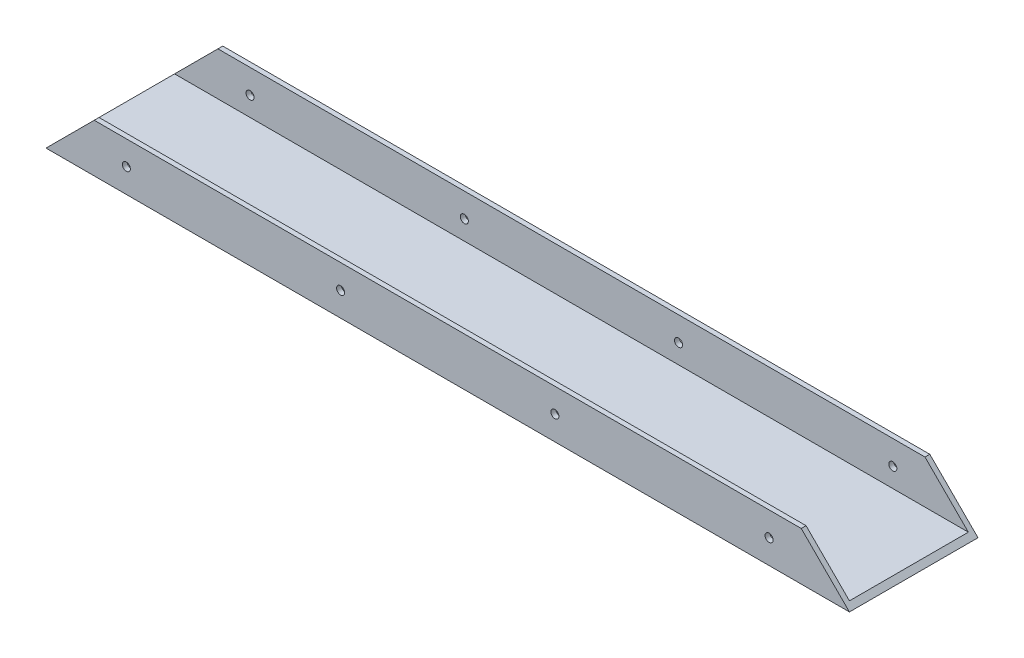
ISO-10303-21;
HEADER;
FILE_DESCRIPTION(('STEP AP214'),'2;1');
FILE_NAME('part.step','',(''),(''),'','','');
FILE_SCHEMA(('AUTOMOTIVE_DESIGN { 1 0 10303 214 1 1 1 1 }'));
ENDSEC;
DATA;
#1=APPLICATION_CONTEXT('core data for automotive mechanical design processes');
#2=APPLICATION_PROTOCOL_DEFINITION('international standard','automotive_design',2000,#1);
#3=PRODUCT_CONTEXT('',#1,'mechanical');
#4=PRODUCT('Part','Part','',(#3));
#5=PRODUCT_RELATED_PRODUCT_CATEGORY('part','',(#4));
#6=PRODUCT_DEFINITION_FORMATION('','',#4);
#7=PRODUCT_DEFINITION_CONTEXT('part definition',#1,'design');
#8=PRODUCT_DEFINITION('design','',#6,#7);
#9=PRODUCT_DEFINITION_SHAPE('','',#8);
#10=(LENGTH_UNIT() NAMED_UNIT(*) SI_UNIT(.MILLI.,.METRE.));
#11=(NAMED_UNIT(*) PLANE_ANGLE_UNIT() SI_UNIT($,.RADIAN.));
#12=(NAMED_UNIT(*) SI_UNIT($,.STERADIAN.) SOLID_ANGLE_UNIT());
#13=UNCERTAINTY_MEASURE_WITH_UNIT(LENGTH_MEASURE(1.E-05),#10,'distance_accuracy_value','');
#14=(GEOMETRIC_REPRESENTATION_CONTEXT(3) GLOBAL_UNCERTAINTY_ASSIGNED_CONTEXT((#13)) GLOBAL_UNIT_ASSIGNED_CONTEXT((#10,
#11,#12)) REPRESENTATION_CONTEXT('',''));
#15=CARTESIAN_POINT('',(0.,0.,0.));
#16=DIRECTION('',(0.,0.,1.));
#17=DIRECTION('',(1.,0.,0.));
#18=AXIS2_PLACEMENT_3D('',#15,#16,#17);
#19=CARTESIAN_POINT('',(250.,15.,-18.5));
#20=DIRECTION('',(0.,0.,-1.));
#21=DIRECTION('',(0.,1.,0.));
#22=AXIS2_PLACEMENT_3D('',#19,#20,#21);
#23=PLANE('',#22);
#24=CARTESIAN_POINT('',(91.6666666666667,7.50000000000018,-18.5));
#25=DIRECTION('',(0.,0.,-1.));
#26=DIRECTION('',(0.,1.,0.));
#27=AXIS2_PLACEMENT_3D('',#24,#25,#26);
#28=CIRCLE('',#27,1.25000000000001);
#29=CARTESIAN_POINT('',(91.6666666666667,8.75000000000019,-18.5));
#30=VERTEX_POINT('',#29);
#31=EDGE_CURVE('E166',#30,#30,#28,.T.);
#32=ORIENTED_EDGE('',*,*,#31,.T.);
#33=EDGE_LOOP('',(#32));
#34=FACE_BOUND('',#33,.T.);
#35=CARTESIAN_POINT('',(158.333333333333,7.49999999999995,-18.5));
#36=DIRECTION('',(0.,0.,-1.));
#37=DIRECTION('',(0.,1.,0.));
#38=AXIS2_PLACEMENT_3D('',#35,#36,#37);
#39=CIRCLE('',#38,1.25000000000001);
#40=CARTESIAN_POINT('',(158.333333333333,8.74999999999997,-18.5));
#41=VERTEX_POINT('',#40);
#42=EDGE_CURVE('E160',#41,#41,#39,.T.);
#43=ORIENTED_EDGE('',*,*,#42,.T.);
#44=EDGE_LOOP('',(#43));
#45=FACE_BOUND('',#44,.T.);
#46=CARTESIAN_POINT('',(225.,7.49999999999973,-18.5));
#47=DIRECTION('',(0.,0.,-1.));
#48=DIRECTION('',(0.,1.,0.));
#49=AXIS2_PLACEMENT_3D('',#46,#47,#48);
#50=CIRCLE('',#49,1.24999999999996);
#51=CARTESIAN_POINT('',(225.,8.74999999999969,-18.5));
#52=VERTEX_POINT('',#51);
#53=EDGE_CURVE('E154',#52,#52,#50,.T.);
#54=ORIENTED_EDGE('',*,*,#53,.T.);
#55=EDGE_LOOP('',(#54));
#56=FACE_BOUND('',#55,.T.);
#57=CARTESIAN_POINT('',(25.,7.50000000000043,-18.5));
#58=DIRECTION('',(0.,0.,-1.));
#59=DIRECTION('',(0.,1.,0.));
#60=AXIS2_PLACEMENT_3D('',#57,#58,#59);
#61=CIRCLE('',#60,1.24999999999996);
#62=CARTESIAN_POINT('',(25.,8.75000000000039,-18.5));
#63=VERTEX_POINT('',#62);
#64=EDGE_CURVE('E148',#63,#63,#61,.T.);
#65=ORIENTED_EDGE('',*,*,#64,.T.);
#66=EDGE_LOOP('',(#65));
#67=FACE_BOUND('',#66,.T.);
#68=DIRECTION('',(-1.,0.,0.));
#69=VECTOR('',#68,1.);
#70=CARTESIAN_POINT('',(250.,1.5,-18.5));
#71=LINE('',#70,#69);
#72=CARTESIAN_POINT('',(248.5,1.5,-18.5));
#73=VERTEX_POINT('',#72);
#74=CARTESIAN_POINT('',(1.5,1.5,-18.5));
#75=VERTEX_POINT('',#74);
#76=EDGE_CURVE('E11',#73,#75,#71,.T.);
#77=ORIENTED_EDGE('',*,*,#76,.F.);
#78=DIRECTION('',(-0.707106781186548,0.707106781186547,0.));
#79=VECTOR('',#78,1.);
#80=CARTESIAN_POINT('',(242.5,7.5,-18.5));
#81=LINE('',#80,#79);
#82=CARTESIAN_POINT('',(235.,15.,-18.5));
#83=VERTEX_POINT('',#82);
#84=EDGE_CURVE('E142',#73,#83,#81,.T.);
#85=ORIENTED_EDGE('',*,*,#84,.T.);
#86=DIRECTION('',(-1.,0.,0.));
#87=VECTOR('',#86,1.);
#88=CARTESIAN_POINT('',(250.,15.,-18.5));
#89=LINE('',#88,#87);
#90=CARTESIAN_POINT('',(15.,15.,-18.5));
#91=VERTEX_POINT('',#90);
#92=EDGE_CURVE('E172',#83,#91,#89,.T.);
#93=ORIENTED_EDGE('',*,*,#92,.T.);
#94=DIRECTION('',(-0.707106781186548,-0.707106781186547,0.));
#95=VECTOR('',#94,1.);
#96=CARTESIAN_POINT('',(132.5,132.5,-18.5));
#97=LINE('',#96,#95);
#98=EDGE_CURVE('E134',#91,#75,#97,.T.);
#99=ORIENTED_EDGE('',*,*,#98,.T.);
#100=EDGE_LOOP('',(#77,#85,#93,#99));
#101=FACE_BOUND('',#100,.T.);
#102=ADVANCED_FACE('F32',(#34,#45,#56,#67,#101),#23,.F.);
#103=CARTESIAN_POINT('',(250.,1.5,-18.5));
#104=DIRECTION('',(0.,-1.,0.));
#105=DIRECTION('',(0.,0.,-1.));
#106=AXIS2_PLACEMENT_3D('',#103,#104,#105);
#107=PLANE('',#106);
#108=DIRECTION('',(-1.,0.,0.));
#109=VECTOR('',#108,1.);
#110=CARTESIAN_POINT('',(250.,1.5,18.5));
#111=LINE('',#110,#109);
#112=CARTESIAN_POINT('',(248.5,1.5,18.5));
#113=VERTEX_POINT('',#112);
#114=CARTESIAN_POINT('',(1.49999999999999,1.49999999999999,18.5));
#115=VERTEX_POINT('',#114);
#116=EDGE_CURVE('E40',#113,#115,#111,.T.);
#117=ORIENTED_EDGE('',*,*,#116,.F.);
#118=DIRECTION('',(0.,0.,-1.));
#119=VECTOR('',#118,1.);
#120=CARTESIAN_POINT('',(248.5,1.5,-18.5));
#121=LINE('',#120,#119);
#122=EDGE_CURVE('E129',#113,#73,#121,.T.);
#123=ORIENTED_EDGE('',*,*,#122,.T.);
#124=ORIENTED_EDGE('',*,*,#76,.T.);
#125=DIRECTION('',(0.,0.,1.));
#126=VECTOR('',#125,1.);
#127=CARTESIAN_POINT('',(1.5,1.5,-18.5));
#128=LINE('',#127,#126);
#129=EDGE_CURVE('E131',#75,#115,#128,.T.);
#130=ORIENTED_EDGE('',*,*,#129,.T.);
#131=EDGE_LOOP('',(#117,#123,#124,#130));
#132=FACE_BOUND('',#131,.T.);
#133=ADVANCED_FACE('F128',(#132),#107,.F.);
#134=CARTESIAN_POINT('',(250.,1.5,18.5));
#135=DIRECTION('',(0.,0.,1.));
#136=DIRECTION('',(1.,0.,0.));
#137=AXIS2_PLACEMENT_3D('',#134,#135,#136);
#138=PLANE('',#137);
#139=CARTESIAN_POINT('',(91.6666666666667,7.50000000000017,18.5));
#140=DIRECTION('',(0.,0.,1.));
#141=DIRECTION('',(1.,0.,0.));
#142=AXIS2_PLACEMENT_3D('',#139,#140,#141);
#143=CIRCLE('',#142,1.25000000000001);
#144=CARTESIAN_POINT('',(92.9166666666667,7.50000000000017,18.5));
#145=VERTEX_POINT('',#144);
#146=EDGE_CURVE('E163',#145,#145,#143,.T.);
#147=ORIENTED_EDGE('',*,*,#146,.T.);
#148=EDGE_LOOP('',(#147));
#149=FACE_BOUND('',#148,.T.);
#150=CARTESIAN_POINT('',(158.333333333333,7.49999999999995,18.5));
#151=DIRECTION('',(0.,0.,1.));
#152=DIRECTION('',(1.,0.,0.));
#153=AXIS2_PLACEMENT_3D('',#150,#151,#152);
#154=CIRCLE('',#153,1.25000000000001);
#155=CARTESIAN_POINT('',(159.583333333333,7.49999999999995,18.5));
#156=VERTEX_POINT('',#155);
#157=EDGE_CURVE('E157',#156,#156,#154,.T.);
#158=ORIENTED_EDGE('',*,*,#157,.T.);
#159=EDGE_LOOP('',(#158));
#160=FACE_BOUND('',#159,.T.);
#161=CARTESIAN_POINT('',(225.,7.49999999999972,18.5));
#162=DIRECTION('',(0.,0.,1.));
#163=DIRECTION('',(1.,0.,0.));
#164=AXIS2_PLACEMENT_3D('',#161,#162,#163);
#165=CIRCLE('',#164,1.24999999999996);
#166=CARTESIAN_POINT('',(226.25,7.49999999999972,18.5));
#167=VERTEX_POINT('',#166);
#168=EDGE_CURVE('E151',#167,#167,#165,.T.);
#169=ORIENTED_EDGE('',*,*,#168,.T.);
#170=EDGE_LOOP('',(#169));
#171=FACE_BOUND('',#170,.T.);
#172=CARTESIAN_POINT('',(25.,7.50000000000042,18.5));
#173=DIRECTION('',(0.,0.,1.));
#174=DIRECTION('',(1.,0.,0.));
#175=AXIS2_PLACEMENT_3D('',#172,#173,#174);
#176=CIRCLE('',#175,1.24999999999996);
#177=CARTESIAN_POINT('',(26.25,7.50000000000042,18.5));
#178=VERTEX_POINT('',#177);
#179=EDGE_CURVE('E145',#178,#178,#176,.T.);
#180=ORIENTED_EDGE('',*,*,#179,.T.);
#181=EDGE_LOOP('',(#180));
#182=FACE_BOUND('',#181,.T.);
#183=DIRECTION('',(-1.,0.,0.));
#184=VECTOR('',#183,1.);
#185=CARTESIAN_POINT('',(250.,15.,18.5));
#186=LINE('',#185,#184);
#187=CARTESIAN_POINT('',(235.,15.,18.5));
#188=VERTEX_POINT('',#187);
#189=CARTESIAN_POINT('',(15.,15.,18.5));
#190=VERTEX_POINT('',#189);
#191=EDGE_CURVE('E114',#188,#190,#186,.T.);
#192=ORIENTED_EDGE('',*,*,#191,.F.);
#193=DIRECTION('',(0.707106781186548,-0.707106781186547,0.));
#194=VECTOR('',#193,1.);
#195=CARTESIAN_POINT('',(249.25,0.75,18.5));
#196=LINE('',#195,#194);
#197=EDGE_CURVE('E93',#188,#113,#196,.T.);
#198=ORIENTED_EDGE('',*,*,#197,.T.);
#199=ORIENTED_EDGE('',*,*,#116,.T.);
#200=DIRECTION('',(0.707106781186548,0.707106781186547,0.));
#201=VECTOR('',#200,1.);
#202=CARTESIAN_POINT('',(125.75,125.75,18.5));
#203=LINE('',#202,#201);
#204=EDGE_CURVE('E98',#115,#190,#203,.T.);
#205=ORIENTED_EDGE('',*,*,#204,.T.);
#206=EDGE_LOOP('',(#192,#198,#199,#205));
#207=FACE_BOUND('',#206,.T.);
#208=ADVANCED_FACE('F124',(#149,#160,#171,#182,#207),#138,.F.);
#209=CARTESIAN_POINT('',(250.,15.,18.5));
#210=DIRECTION('',(0.,-1.,0.));
#211=DIRECTION('',(0.,0.,-1.));
#212=AXIS2_PLACEMENT_3D('',#209,#210,#211);
#213=PLANE('',#212);
#214=DIRECTION('',(-1.,0.,0.));
#215=VECTOR('',#214,1.);
#216=CARTESIAN_POINT('',(250.,15.,20.));
#217=LINE('',#216,#215);
#218=CARTESIAN_POINT('',(235.,15.,20.));
#219=VERTEX_POINT('',#218);
#220=CARTESIAN_POINT('',(15.,15.,20.));
#221=VERTEX_POINT('',#220);
#222=EDGE_CURVE('E105',#219,#221,#217,.T.);
#223=ORIENTED_EDGE('',*,*,#222,.F.);
#224=DIRECTION('',(0.,0.,-1.));
#225=VECTOR('',#224,1.);
#226=CARTESIAN_POINT('',(235.,15.,20.));
#227=LINE('',#226,#225);
#228=EDGE_CURVE('E90',#219,#188,#227,.T.);
#229=ORIENTED_EDGE('',*,*,#228,.T.);
#230=ORIENTED_EDGE('',*,*,#191,.T.);
#231=DIRECTION('',(0.,0.,-1.));
#232=VECTOR('',#231,1.);
#233=CARTESIAN_POINT('',(15.,15.,20.));
#234=LINE('',#233,#232);
#235=EDGE_CURVE('E113',#221,#190,#234,.T.);
#236=ORIENTED_EDGE('',*,*,#235,.F.);
#237=EDGE_LOOP('',(#223,#229,#230,#236));
#238=FACE_BOUND('',#237,.T.);
#239=ADVANCED_FACE('F112',(#238),#213,.F.);
#240=CARTESIAN_POINT('',(250.,15.,20.));
#241=DIRECTION('',(0.,0.,-1.));
#242=DIRECTION('',(0.,1.,0.));
#243=AXIS2_PLACEMENT_3D('',#240,#241,#242);
#244=PLANE('',#243);
#245=CARTESIAN_POINT('',(91.6666666666667,7.50000000000017,20.));
#246=DIRECTION('',(0.,0.,-1.));
#247=DIRECTION('',(0.,1.,0.));
#248=AXIS2_PLACEMENT_3D('',#245,#246,#247);
#249=CIRCLE('',#248,1.25000000000001);
#250=CARTESIAN_POINT('',(91.6666666666667,8.75000000000018,20.));
#251=VERTEX_POINT('',#250);
#252=EDGE_CURVE('E215',#251,#251,#249,.T.);
#253=ORIENTED_EDGE('',*,*,#252,.T.);
#254=EDGE_LOOP('',(#253));
#255=FACE_BOUND('',#254,.T.);
#256=CARTESIAN_POINT('',(158.333333333333,7.49999999999995,20.));
#257=DIRECTION('',(0.,0.,-1.));
#258=DIRECTION('',(0.,1.,0.));
#259=AXIS2_PLACEMENT_3D('',#256,#257,#258);
#260=CIRCLE('',#259,1.25000000000001);
#261=CARTESIAN_POINT('',(158.333333333333,8.74999999999996,20.));
#262=VERTEX_POINT('',#261);
#263=EDGE_CURVE('E211',#262,#262,#260,.T.);
#264=ORIENTED_EDGE('',*,*,#263,.T.);
#265=EDGE_LOOP('',(#264));
#266=FACE_BOUND('',#265,.T.);
#267=CARTESIAN_POINT('',(225.,7.49999999999972,20.));
#268=DIRECTION('',(0.,0.,-1.));
#269=DIRECTION('',(0.,1.,0.));
#270=AXIS2_PLACEMENT_3D('',#267,#268,#269);
#271=CIRCLE('',#270,1.24999999999996);
#272=CARTESIAN_POINT('',(225.,8.74999999999968,20.));
#273=VERTEX_POINT('',#272);
#274=EDGE_CURVE('E205',#273,#273,#271,.T.);
#275=ORIENTED_EDGE('',*,*,#274,.T.);
#276=EDGE_LOOP('',(#275));
#277=FACE_BOUND('',#276,.T.);
#278=CARTESIAN_POINT('',(25.,7.50000000000042,20.));
#279=DIRECTION('',(0.,0.,-1.));
#280=DIRECTION('',(0.,-1.,0.));
#281=AXIS2_PLACEMENT_3D('',#278,#279,#280);
#282=CIRCLE('',#281,1.24999999999996);
#283=CARTESIAN_POINT('',(25.,6.25000000000046,20.));
#284=VERTEX_POINT('',#283);
#285=EDGE_CURVE('E194',#284,#284,#282,.T.);
#286=ORIENTED_EDGE('',*,*,#285,.T.);
#287=EDGE_LOOP('',(#286));
#288=FACE_BOUND('',#287,.T.);
#289=DIRECTION('',(-1.,0.,0.));
#290=VECTOR('',#289,1.);
#291=CARTESIAN_POINT('',(250.,0.,20.));
#292=LINE('',#291,#290);
#293=CARTESIAN_POINT('',(250.,0.,20.));
#294=VERTEX_POINT('',#293);
#295=CARTESIAN_POINT('',(0.,0.,20.));
#296=VERTEX_POINT('',#295);
#297=EDGE_CURVE('E107',#294,#296,#292,.T.);
#298=ORIENTED_EDGE('',*,*,#297,.F.);
#299=DIRECTION('',(-0.707106781186548,0.707106781186547,0.));
#300=VECTOR('',#299,1.);
#301=CARTESIAN_POINT('',(235.,15.,20.));
#302=LINE('',#301,#300);
#303=EDGE_CURVE('E46',#294,#219,#302,.T.);
#304=ORIENTED_EDGE('',*,*,#303,.T.);
#305=ORIENTED_EDGE('',*,*,#222,.T.);
#306=DIRECTION('',(-0.707106781186548,-0.707106781186547,0.));
#307=VECTOR('',#306,1.);
#308=CARTESIAN_POINT('',(15.,15.,20.));
#309=LINE('',#308,#307);
#310=EDGE_CURVE('E190',#221,#296,#309,.T.);
#311=ORIENTED_EDGE('',*,*,#310,.T.);
#312=EDGE_LOOP('',(#298,#304,#305,#311));
#313=FACE_BOUND('',#312,.T.);
#314=ADVANCED_FACE('F103',(#255,#266,#277,#288,#313),#244,.F.);
#315=CARTESIAN_POINT('',(250.,0.,20.));
#316=DIRECTION('',(0.,1.,0.));
#317=DIRECTION('',(0.,0.,1.));
#318=AXIS2_PLACEMENT_3D('',#315,#316,#317);
#319=PLANE('',#318);
#320=DIRECTION('',(0.,0.,-1.));
#321=VECTOR('',#320,1.);
#322=CARTESIAN_POINT('',(0.,0.,20.));
#323=LINE('',#322,#321);
#324=CARTESIAN_POINT('',(0.,0.,-20.));
#325=VERTEX_POINT('',#324);
#326=EDGE_CURVE('E169',#296,#325,#323,.T.);
#327=ORIENTED_EDGE('',*,*,#326,.T.);
#328=DIRECTION('',(-1.,0.,0.));
#329=VECTOR('',#328,1.);
#330=CARTESIAN_POINT('',(250.,0.,-20.));
#331=LINE('',#330,#329);
#332=CARTESIAN_POINT('',(250.,0.,-20.));
#333=VERTEX_POINT('',#332);
#334=EDGE_CURVE('E117',#333,#325,#331,.T.);
#335=ORIENTED_EDGE('',*,*,#334,.F.);
#336=DIRECTION('',(0.,0.,-1.));
#337=VECTOR('',#336,1.);
#338=CARTESIAN_POINT('',(250.,0.,20.));
#339=LINE('',#338,#337);
#340=EDGE_CURVE('E170',#294,#333,#339,.T.);
#341=ORIENTED_EDGE('',*,*,#340,.F.);
#342=ORIENTED_EDGE('',*,*,#297,.T.);
#343=EDGE_LOOP('',(#327,#335,#341,#342));
#344=FACE_BOUND('',#343,.T.);
#345=ADVANCED_FACE('F188',(#344),#319,.F.);
#346=CARTESIAN_POINT('',(250.,0.,-20.));
#347=DIRECTION('',(0.,0.,1.));
#348=DIRECTION('',(0.,-1.,0.));
#349=AXIS2_PLACEMENT_3D('',#346,#347,#348);
#350=PLANE('',#349);
#351=CARTESIAN_POINT('',(91.6666666666667,7.50000000000018,-20.));
#352=DIRECTION('',(0.,0.,-1.));
#353=DIRECTION('',(0.,1.,0.));
#354=AXIS2_PLACEMENT_3D('',#351,#352,#353);
#355=CIRCLE('',#354,1.25000000000001);
#356=CARTESIAN_POINT('',(91.6666666666667,8.75000000000019,-20.));
#357=VERTEX_POINT('',#356);
#358=EDGE_CURVE('E197',#357,#357,#355,.T.);
#359=ORIENTED_EDGE('',*,*,#358,.F.);
#360=EDGE_LOOP('',(#359));
#361=FACE_BOUND('',#360,.T.);
#362=CARTESIAN_POINT('',(158.333333333333,7.49999999999996,-20.));
#363=DIRECTION('',(0.,0.,-1.));
#364=DIRECTION('',(0.,1.,0.));
#365=AXIS2_PLACEMENT_3D('',#362,#363,#364);
#366=CIRCLE('',#365,1.25000000000001);
#367=CARTESIAN_POINT('',(158.333333333333,8.74999999999997,-20.));
#368=VERTEX_POINT('',#367);
#369=EDGE_CURVE('E213',#368,#368,#366,.T.);
#370=ORIENTED_EDGE('',*,*,#369,.F.);
#371=EDGE_LOOP('',(#370));
#372=FACE_BOUND('',#371,.T.);
#373=CARTESIAN_POINT('',(225.,7.49999999999973,-20.));
#374=DIRECTION('',(0.,0.,-1.));
#375=DIRECTION('',(0.,1.,0.));
#376=AXIS2_PLACEMENT_3D('',#373,#374,#375);
#377=CIRCLE('',#376,1.24999999999996);
#378=CARTESIAN_POINT('',(225.,8.74999999999969,-20.));
#379=VERTEX_POINT('',#378);
#380=EDGE_CURVE('E208',#379,#379,#377,.T.);
#381=ORIENTED_EDGE('',*,*,#380,.F.);
#382=EDGE_LOOP('',(#381));
#383=FACE_BOUND('',#382,.T.);
#384=CARTESIAN_POINT('',(25.,7.50000000000043,-20.));
#385=DIRECTION('',(0.,0.,-1.));
#386=DIRECTION('',(0.,-1.,0.));
#387=AXIS2_PLACEMENT_3D('',#384,#385,#386);
#388=CIRCLE('',#387,1.24999999999996);
#389=CARTESIAN_POINT('',(25.,6.25000000000047,-20.));
#390=VERTEX_POINT('',#389);
#391=EDGE_CURVE('E202',#390,#390,#388,.T.);
#392=ORIENTED_EDGE('',*,*,#391,.F.);
#393=EDGE_LOOP('',(#392));
#394=FACE_BOUND('',#393,.T.);
#395=DIRECTION('',(-1.,0.,0.));
#396=VECTOR('',#395,1.);
#397=CARTESIAN_POINT('',(250.,15.,-20.));
#398=LINE('',#397,#396);
#399=CARTESIAN_POINT('',(235.,15.,-20.));
#400=VERTEX_POINT('',#399);
#401=CARTESIAN_POINT('',(15.,15.,-20.));
#402=VERTEX_POINT('',#401);
#403=EDGE_CURVE('E177',#400,#402,#398,.T.);
#404=ORIENTED_EDGE('',*,*,#403,.F.);
#405=DIRECTION('',(-0.707106781186548,0.707106781186547,0.));
#406=VECTOR('',#405,1.);
#407=CARTESIAN_POINT('',(235.,15.,-20.));
#408=LINE('',#407,#406);
#409=EDGE_CURVE('E109',#333,#400,#408,.T.);
#410=ORIENTED_EDGE('',*,*,#409,.F.);
#411=ORIENTED_EDGE('',*,*,#334,.T.);
#412=DIRECTION('',(-0.707106781186548,-0.707106781186547,0.));
#413=VECTOR('',#412,1.);
#414=CARTESIAN_POINT('',(15.,15.,-20.));
#415=LINE('',#414,#413);
#416=EDGE_CURVE('E186',#402,#325,#415,.T.);
#417=ORIENTED_EDGE('',*,*,#416,.F.);
#418=EDGE_LOOP('',(#404,#410,#411,#417));
#419=FACE_BOUND('',#418,.T.);
#420=ADVANCED_FACE('F185',(#361,#372,#383,#394,#419),#350,.F.);
#421=CARTESIAN_POINT('',(250.,15.,-20.));
#422=DIRECTION('',(0.,-1.,0.));
#423=DIRECTION('',(0.,0.,-1.));
#424=AXIS2_PLACEMENT_3D('',#421,#422,#423);
#425=PLANE('',#424);
#426=ORIENTED_EDGE('',*,*,#92,.F.);
#427=EDGE_CURVE('E99',#83,#400,#227,.T.);
#428=ORIENTED_EDGE('',*,*,#427,.T.);
#429=ORIENTED_EDGE('',*,*,#403,.T.);
#430=EDGE_CURVE('E191',#91,#402,#234,.T.);
#431=ORIENTED_EDGE('',*,*,#430,.F.);
#432=EDGE_LOOP('',(#426,#428,#429,#431));
#433=FACE_BOUND('',#432,.T.);
#434=ADVANCED_FACE('F226',(#433),#425,.F.);
#435=CARTESIAN_POINT('',(15.,15.,20.));
#436=DIRECTION('',(0.707106781186547,-0.707106781186548,0.));
#437=DIRECTION('',(0.707106781186548,0.707106781186547,0.));
#438=AXIS2_PLACEMENT_3D('',#435,#436,#437);
#439=PLANE('',#438);
#440=ORIENTED_EDGE('',*,*,#430,.T.);
#441=ORIENTED_EDGE('',*,*,#416,.T.);
#442=ORIENTED_EDGE('',*,*,#326,.F.);
#443=ORIENTED_EDGE('',*,*,#310,.F.);
#444=ORIENTED_EDGE('',*,*,#235,.T.);
#445=ORIENTED_EDGE('',*,*,#204,.F.);
#446=ORIENTED_EDGE('',*,*,#129,.F.);
#447=ORIENTED_EDGE('',*,*,#98,.F.);
#448=EDGE_LOOP('',(#440,#441,#442,#443,#444,#445,#446,#447));
#449=FACE_BOUND('',#448,.T.);
#450=ADVANCED_FACE('F189',(#449),#439,.F.);
#451=CARTESIAN_POINT('',(235.,15.,20.));
#452=DIRECTION('',(-0.707106781186547,-0.707106781186548,0.));
#453=DIRECTION('',(0.707106781186548,-0.707106781186547,0.));
#454=AXIS2_PLACEMENT_3D('',#451,#452,#453);
#455=PLANE('',#454);
#456=ORIENTED_EDGE('',*,*,#122,.F.);
#457=ORIENTED_EDGE('',*,*,#197,.F.);
#458=ORIENTED_EDGE('',*,*,#228,.F.);
#459=ORIENTED_EDGE('',*,*,#303,.F.);
#460=ORIENTED_EDGE('',*,*,#340,.T.);
#461=ORIENTED_EDGE('',*,*,#409,.T.);
#462=ORIENTED_EDGE('',*,*,#427,.F.);
#463=ORIENTED_EDGE('',*,*,#84,.F.);
#464=EDGE_LOOP('',(#456,#457,#458,#459,#460,#461,#462,#463));
#465=FACE_BOUND('',#464,.T.);
#466=ADVANCED_FACE('F91',(#465),#455,.F.);
#467=CARTESIAN_POINT('',(25.,7.50000000000042,20.));
#468=DIRECTION('',(0.,0.,-1.));
#469=DIRECTION('',(0.,1.,0.));
#470=AXIS2_PLACEMENT_3D('',#467,#468,#469);
#471=CYLINDRICAL_SURFACE('',#470,1.24999999999996);
#472=ORIENTED_EDGE('',*,*,#391,.T.);
#473=EDGE_LOOP('',(#472));
#474=FACE_BOUND('',#473,.T.);
#475=ORIENTED_EDGE('',*,*,#64,.F.);
#476=EDGE_LOOP('',(#475));
#477=FACE_BOUND('',#476,.T.);
#478=ADVANCED_FACE('F242',(#474,#477),#471,.F.);
#479=CARTESIAN_POINT('',(225.,7.49999999999972,20.));
#480=DIRECTION('',(0.,0.,-1.));
#481=DIRECTION('',(0.,1.,0.));
#482=AXIS2_PLACEMENT_3D('',#479,#480,#481);
#483=CYLINDRICAL_SURFACE('',#482,1.24999999999996);
#484=ORIENTED_EDGE('',*,*,#380,.T.);
#485=EDGE_LOOP('',(#484));
#486=FACE_BOUND('',#485,.T.);
#487=ORIENTED_EDGE('',*,*,#53,.F.);
#488=EDGE_LOOP('',(#487));
#489=FACE_BOUND('',#488,.T.);
#490=ADVANCED_FACE('F244',(#486,#489),#483,.F.);
#491=CARTESIAN_POINT('',(158.333333333333,7.49999999999995,20.));
#492=DIRECTION('',(0.,0.,-1.));
#493=DIRECTION('',(0.,1.,0.));
#494=AXIS2_PLACEMENT_3D('',#491,#492,#493);
#495=CYLINDRICAL_SURFACE('',#494,1.25000000000001);
#496=ORIENTED_EDGE('',*,*,#369,.T.);
#497=EDGE_LOOP('',(#496));
#498=FACE_BOUND('',#497,.T.);
#499=ORIENTED_EDGE('',*,*,#42,.F.);
#500=EDGE_LOOP('',(#499));
#501=FACE_BOUND('',#500,.T.);
#502=ADVANCED_FACE('F252',(#498,#501),#495,.F.);
#503=CARTESIAN_POINT('',(91.6666666666667,7.50000000000017,20.));
#504=DIRECTION('',(0.,0.,-1.));
#505=DIRECTION('',(0.,1.,0.));
#506=AXIS2_PLACEMENT_3D('',#503,#504,#505);
#507=CYLINDRICAL_SURFACE('',#506,1.25000000000001);
#508=ORIENTED_EDGE('',*,*,#358,.T.);
#509=EDGE_LOOP('',(#508));
#510=FACE_BOUND('',#509,.T.);
#511=ORIENTED_EDGE('',*,*,#31,.F.);
#512=EDGE_LOOP('',(#511));
#513=FACE_BOUND('',#512,.T.);
#514=ADVANCED_FACE('F259',(#510,#513),#507,.F.);
#515=ORIENTED_EDGE('',*,*,#285,.F.);
#516=EDGE_LOOP('',(#515));
#517=FACE_BOUND('',#516,.T.);
#518=ORIENTED_EDGE('',*,*,#179,.F.);
#519=EDGE_LOOP('',(#518));
#520=FACE_BOUND('',#519,.T.);
#521=ADVANCED_FACE('F247',(#517,#520),#471,.F.);
#522=ORIENTED_EDGE('',*,*,#274,.F.);
#523=EDGE_LOOP('',(#522));
#524=FACE_BOUND('',#523,.T.);
#525=ORIENTED_EDGE('',*,*,#168,.F.);
#526=EDGE_LOOP('',(#525));
#527=FACE_BOUND('',#526,.T.);
#528=ADVANCED_FACE('F255',(#524,#527),#483,.F.);
#529=ORIENTED_EDGE('',*,*,#263,.F.);
#530=EDGE_LOOP('',(#529));
#531=FACE_BOUND('',#530,.T.);
#532=ORIENTED_EDGE('',*,*,#157,.F.);
#533=EDGE_LOOP('',(#532));
#534=FACE_BOUND('',#533,.T.);
#535=ADVANCED_FACE('F265',(#531,#534),#495,.F.);
#536=ORIENTED_EDGE('',*,*,#252,.F.);
#537=EDGE_LOOP('',(#536));
#538=FACE_BOUND('',#537,.T.);
#539=ORIENTED_EDGE('',*,*,#146,.F.);
#540=EDGE_LOOP('',(#539));
#541=FACE_BOUND('',#540,.T.);
#542=ADVANCED_FACE('F269',(#538,#541),#507,.F.);
#543=CLOSED_SHELL('',(#102,#133,#208,#239,#314,#345,#420,#434,#450,#466,#478,#490,#502,#514,
#521,#528,#535,#542));
#544=MANIFOLD_SOLID_BREP('B2',#543);
#545=ADVANCED_BREP_SHAPE_REPRESENTATION('',(#18,#544),#14);
#546=SHAPE_DEFINITION_REPRESENTATION(#9,#545);
ENDSEC;
END-ISO-10303-21;
